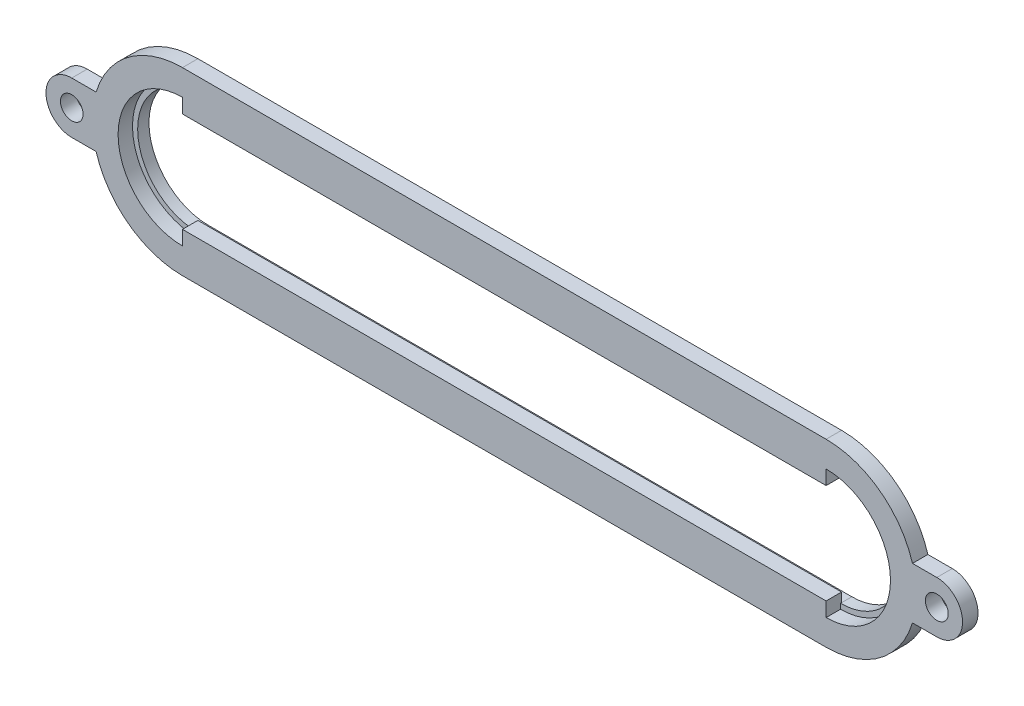
ISO-10303-21;
HEADER;
FILE_DESCRIPTION(('STEP AP214'),'2;1');
FILE_NAME('part.step','',(''),(''),'','','');
FILE_SCHEMA(('AUTOMOTIVE_DESIGN { 1 0 10303 214 1 1 1 1 }'));
ENDSEC;
DATA;
#1=APPLICATION_CONTEXT('core data for automotive mechanical design processes');
#2=APPLICATION_PROTOCOL_DEFINITION('international standard','automotive_design',2000,#1);
#3=PRODUCT_CONTEXT('',#1,'mechanical');
#4=PRODUCT('Part','Part','',(#3));
#5=PRODUCT_RELATED_PRODUCT_CATEGORY('part','',(#4));
#6=PRODUCT_DEFINITION_FORMATION('','',#4);
#7=PRODUCT_DEFINITION_CONTEXT('part definition',#1,'design');
#8=PRODUCT_DEFINITION('design','',#6,#7);
#9=PRODUCT_DEFINITION_SHAPE('','',#8);
#10=(LENGTH_UNIT() NAMED_UNIT(*) SI_UNIT(.MILLI.,.METRE.));
#11=(NAMED_UNIT(*) PLANE_ANGLE_UNIT() SI_UNIT($,.RADIAN.));
#12=(NAMED_UNIT(*) SI_UNIT($,.STERADIAN.) SOLID_ANGLE_UNIT());
#13=UNCERTAINTY_MEASURE_WITH_UNIT(LENGTH_MEASURE(1.E-05),#10,'distance_accuracy_value','');
#14=(GEOMETRIC_REPRESENTATION_CONTEXT(3) GLOBAL_UNCERTAINTY_ASSIGNED_CONTEXT((#13)) GLOBAL_UNIT_ASSIGNED_CONTEXT((#10,
#11,#12)) REPRESENTATION_CONTEXT('',''));
#15=CARTESIAN_POINT('',(0.,0.,0.));
#16=DIRECTION('',(0.,0.,1.));
#17=DIRECTION('',(1.,0.,0.));
#18=AXIS2_PLACEMENT_3D('',#15,#16,#17);
#19=CARTESIAN_POINT('',(19.1305960582726,0.,3.81));
#20=DIRECTION('',(0.,0.,-1.));
#21=DIRECTION('',(-1.,0.,0.));
#22=AXIS2_PLACEMENT_3D('',#19,#20,#21);
#23=CYLINDRICAL_SURFACE('',#22,22.225);
#24=DIRECTION('',(0.,0.,1.));
#25=VECTOR('',#24,1.);
#26=CARTESIAN_POINT('',(-2.16795142741293,6.35,0.));
#27=LINE('',#26,#25);
#28=CARTESIAN_POINT('',(-2.16795142741292,6.35,0.));
#29=VERTEX_POINT('',#28);
#30=CARTESIAN_POINT('',(-2.16795142741293,6.35,3.81));
#31=VERTEX_POINT('',#30);
#32=EDGE_CURVE('E274',#29,#31,#27,.T.);
#33=ORIENTED_EDGE('',*,*,#32,.T.);
#34=CARTESIAN_POINT('',(19.1305960582726,0.,3.81));
#35=DIRECTION('',(0.,0.,1.));
#36=DIRECTION('',(1.,0.,0.));
#37=AXIS2_PLACEMENT_3D('',#34,#35,#36);
#38=CIRCLE('',#37,22.225);
#39=CARTESIAN_POINT('',(19.1305960582726,22.225,3.81));
#40=VERTEX_POINT('',#39);
#41=EDGE_CURVE('E407',#31,#40,#38,.F.);
#42=ORIENTED_EDGE('',*,*,#41,.T.);
#43=DIRECTION('',(0.,0.,-1.));
#44=VECTOR('',#43,1.);
#45=CARTESIAN_POINT('',(19.1305960582726,22.225,3.81));
#46=LINE('',#45,#44);
#47=CARTESIAN_POINT('',(19.1305960582726,22.225,0.));
#48=VERTEX_POINT('',#47);
#49=EDGE_CURVE('E443',#40,#48,#46,.T.);
#50=ORIENTED_EDGE('',*,*,#49,.T.);
#51=CARTESIAN_POINT('',(19.1305960582726,0.,0.));
#52=DIRECTION('',(0.,0.,1.));
#53=DIRECTION('',(1.,0.,0.));
#54=AXIS2_PLACEMENT_3D('',#51,#52,#53);
#55=CIRCLE('',#54,22.225);
#56=EDGE_CURVE('E52',#29,#48,#55,.F.);
#57=ORIENTED_EDGE('',*,*,#56,.F.);
#58=EDGE_LOOP('',(#33,#42,#50,#57));
#59=FACE_BOUND('',#58,.T.);
#60=ADVANCED_FACE('F37',(#59),#23,.T.);
#61=CARTESIAN_POINT('',(177.880596058273,0.,3.81));
#62=DIRECTION('',(0.,0.,-1.));
#63=DIRECTION('',(-1.,0.,0.));
#64=AXIS2_PLACEMENT_3D('',#61,#62,#63);
#65=CYLINDRICAL_SURFACE('',#64,22.225);
#66=CARTESIAN_POINT('',(177.880596058273,0.,0.));
#67=DIRECTION('',(0.,0.,1.));
#68=DIRECTION('',(1.,0.,0.));
#69=AXIS2_PLACEMENT_3D('',#66,#67,#68);
#70=CIRCLE('',#69,22.225);
#71=CARTESIAN_POINT('',(177.880596058273,-22.225,0.));
#72=VERTEX_POINT('',#71);
#73=CARTESIAN_POINT('',(199.179143543958,-6.35,0.));
#74=VERTEX_POINT('',#73);
#75=EDGE_CURVE('E434',#72,#74,#70,.T.);
#76=ORIENTED_EDGE('',*,*,#75,.T.);
#77=DIRECTION('',(0.,0.,1.));
#78=VECTOR('',#77,1.);
#79=CARTESIAN_POINT('',(199.179143543958,-6.35,0.));
#80=LINE('',#79,#78);
#81=CARTESIAN_POINT('',(199.179143543958,-6.35,3.81));
#82=VERTEX_POINT('',#81);
#83=EDGE_CURVE('E302',#74,#82,#80,.T.);
#84=ORIENTED_EDGE('',*,*,#83,.T.);
#85=CARTESIAN_POINT('',(177.880596058273,0.,3.81));
#86=DIRECTION('',(0.,0.,1.));
#87=DIRECTION('',(1.,0.,0.));
#88=AXIS2_PLACEMENT_3D('',#85,#86,#87);
#89=CIRCLE('',#88,22.225);
#90=CARTESIAN_POINT('',(177.880596058273,-22.225,3.81));
#91=VERTEX_POINT('',#90);
#92=EDGE_CURVE('E401',#91,#82,#89,.T.);
#93=ORIENTED_EDGE('',*,*,#92,.F.);
#94=DIRECTION('',(0.,0.,-1.));
#95=VECTOR('',#94,1.);
#96=CARTESIAN_POINT('',(177.880596058273,-22.225,3.81));
#97=LINE('',#96,#95);
#98=EDGE_CURVE('E449',#91,#72,#97,.T.);
#99=ORIENTED_EDGE('',*,*,#98,.T.);
#100=EDGE_LOOP('',(#76,#84,#93,#99));
#101=FACE_BOUND('',#100,.T.);
#102=ADVANCED_FACE('F518',(#101),#65,.T.);
#103=CARTESIAN_POINT('',(19.1305960582726,0.,3.81));
#104=DIRECTION('',(1.,0.,0.));
#105=DIRECTION('',(0.,1.,0.));
#106=AXIS2_PLACEMENT_3D('',#103,#104,#105);
#107=PLANE('',#106);
#108=DIRECTION('',(0.,0.,-1.));
#109=VECTOR('',#108,1.);
#110=CARTESIAN_POINT('',(19.1305960582726,-14.605,0.254));
#111=LINE('',#110,#109);
#112=CARTESIAN_POINT('',(19.1305960582726,-14.605,0.254));
#113=VERTEX_POINT('',#112);
#114=CARTESIAN_POINT('',(19.1305960582726,-14.605,0.));
#115=VERTEX_POINT('',#114);
#116=EDGE_CURVE('E365',#113,#115,#111,.T.);
#117=ORIENTED_EDGE('',*,*,#116,.F.);
#118=DIRECTION('',(0.,1.,0.));
#119=VECTOR('',#118,1.);
#120=CARTESIAN_POINT('',(19.1305960582726,0.,0.254));
#121=LINE('',#120,#119);
#122=CARTESIAN_POINT('',(19.1305960582726,-15.875,0.254000000000001));
#123=VERTEX_POINT('',#122);
#124=EDGE_CURVE('E372',#123,#113,#121,.T.);
#125=ORIENTED_EDGE('',*,*,#124,.F.);
#126=DIRECTION('',(0.,0.,-1.));
#127=VECTOR('',#126,1.);
#128=CARTESIAN_POINT('',(19.1305960582726,-15.875,3.81));
#129=LINE('',#128,#127);
#130=CARTESIAN_POINT('',(19.1305960582726,-15.875,3.81));
#131=VERTEX_POINT('',#130);
#132=EDGE_CURVE('E444',#131,#123,#129,.T.);
#133=ORIENTED_EDGE('',*,*,#132,.F.);
#134=DIRECTION('',(0.,-1.,0.));
#135=VECTOR('',#134,1.);
#136=CARTESIAN_POINT('',(19.1305960582726,0.,3.81));
#137=LINE('',#136,#135);
#138=CARTESIAN_POINT('',(19.1305960582726,-12.319,3.81));
#139=VERTEX_POINT('',#138);
#140=EDGE_CURVE('E376',#139,#131,#137,.T.);
#141=ORIENTED_EDGE('',*,*,#140,.F.);
#142=DIRECTION('',(0.,0.,-1.));
#143=VECTOR('',#142,1.);
#144=CARTESIAN_POINT('',(19.1305960582726,-12.319,3.81));
#145=LINE('',#144,#143);
#146=CARTESIAN_POINT('',(19.1305960582726,-12.319,0.));
#147=VERTEX_POINT('',#146);
#148=EDGE_CURVE('E410',#139,#147,#145,.T.);
#149=ORIENTED_EDGE('',*,*,#148,.T.);
#150=DIRECTION('',(0.,-1.,0.));
#151=VECTOR('',#150,1.);
#152=CARTESIAN_POINT('',(19.1305960582726,0.,0.));
#153=LINE('',#152,#151);
#154=EDGE_CURVE('E375',#147,#115,#153,.T.);
#155=ORIENTED_EDGE('',*,*,#154,.T.);
#156=EDGE_LOOP('',(#117,#125,#133,#141,#149,#155));
#157=FACE_BOUND('',#156,.T.);
#158=ADVANCED_FACE('F39',(#157),#107,.F.);
#159=CARTESIAN_POINT('',(19.1305960582726,0.,3.81));
#160=DIRECTION('',(0.,0.,-1.));
#161=DIRECTION('',(-1.,0.,0.));
#162=AXIS2_PLACEMENT_3D('',#159,#160,#161);
#163=CYLINDRICAL_SURFACE('',#162,15.875);
#164=CARTESIAN_POINT('',(19.1305960582726,0.,0.254));
#165=DIRECTION('',(0.,0.,-1.));
#166=DIRECTION('',(-1.,0.,0.));
#167=AXIS2_PLACEMENT_3D('',#164,#165,#166);
#168=CIRCLE('',#167,15.875);
#169=CARTESIAN_POINT('',(19.1305960582726,15.875,0.254000000000001));
#170=VERTEX_POINT('',#169);
#171=EDGE_CURVE('E341',#170,#123,#168,.F.);
#172=ORIENTED_EDGE('',*,*,#171,.F.);
#173=DIRECTION('',(0.,0.,-1.));
#174=VECTOR('',#173,1.);
#175=CARTESIAN_POINT('',(19.1305960582726,15.875,3.81));
#176=LINE('',#175,#174);
#177=CARTESIAN_POINT('',(19.1305960582726,15.875,3.81));
#178=VERTEX_POINT('',#177);
#179=EDGE_CURVE('E468',#178,#170,#176,.T.);
#180=ORIENTED_EDGE('',*,*,#179,.F.);
#181=CARTESIAN_POINT('',(19.1305960582726,0.,3.81));
#182=DIRECTION('',(0.,0.,1.));
#183=DIRECTION('',(1.,0.,0.));
#184=AXIS2_PLACEMENT_3D('',#181,#182,#183);
#185=CIRCLE('',#184,15.875);
#186=EDGE_CURVE('E379',#131,#178,#185,.F.);
#187=ORIENTED_EDGE('',*,*,#186,.F.);
#188=ORIENTED_EDGE('',*,*,#132,.T.);
#189=EDGE_LOOP('',(#172,#180,#187,#188));
#190=FACE_BOUND('',#189,.T.);
#191=ADVANCED_FACE('F558',(#190),#163,.F.);
#192=CARTESIAN_POINT('',(177.880596058273,0.,3.81));
#193=DIRECTION('',(0.,0.,-1.));
#194=DIRECTION('',(-1.,0.,0.));
#195=AXIS2_PLACEMENT_3D('',#192,#193,#194);
#196=CYLINDRICAL_SURFACE('',#195,15.875);
#197=DIRECTION('',(0.,0.,-1.));
#198=VECTOR('',#197,1.);
#199=CARTESIAN_POINT('',(177.880596058273,15.875,3.81));
#200=LINE('',#199,#198);
#201=CARTESIAN_POINT('',(177.880596058273,15.875,3.81));
#202=VERTEX_POINT('',#201);
#203=CARTESIAN_POINT('',(177.880596058273,15.875,0.254000000000001));
#204=VERTEX_POINT('',#203);
#205=EDGE_CURVE('E459',#202,#204,#200,.T.);
#206=ORIENTED_EDGE('',*,*,#205,.T.);
#207=CARTESIAN_POINT('',(177.880596058273,0.,0.254));
#208=DIRECTION('',(0.,0.,-1.));
#209=DIRECTION('',(-1.,0.,0.));
#210=AXIS2_PLACEMENT_3D('',#207,#208,#209);
#211=CIRCLE('',#210,15.875);
#212=CARTESIAN_POINT('',(177.880596058273,-15.875,0.254000000000001));
#213=VERTEX_POINT('',#212);
#214=EDGE_CURVE('E338',#213,#204,#211,.F.);
#215=ORIENTED_EDGE('',*,*,#214,.F.);
#216=DIRECTION('',(0.,0.,-1.));
#217=VECTOR('',#216,1.);
#218=CARTESIAN_POINT('',(177.880596058273,-15.875,3.81));
#219=LINE('',#218,#217);
#220=CARTESIAN_POINT('',(177.880596058273,-15.875,3.81));
#221=VERTEX_POINT('',#220);
#222=EDGE_CURVE('E456',#221,#213,#219,.T.);
#223=ORIENTED_EDGE('',*,*,#222,.F.);
#224=CARTESIAN_POINT('',(177.880596058273,0.,3.81));
#225=DIRECTION('',(0.,0.,1.));
#226=DIRECTION('',(1.,0.,0.));
#227=AXIS2_PLACEMENT_3D('',#224,#225,#226);
#228=CIRCLE('',#227,15.875);
#229=EDGE_CURVE('E388',#221,#202,#228,.T.);
#230=ORIENTED_EDGE('',*,*,#229,.T.);
#231=EDGE_LOOP('',(#206,#215,#223,#230));
#232=FACE_BOUND('',#231,.T.);
#233=ADVANCED_FACE('F555',(#232),#196,.F.);
#234=CARTESIAN_POINT('',(177.880596058273,0.,3.81));
#235=DIRECTION('',(1.,0.,0.));
#236=DIRECTION('',(0.,0.,-1.));
#237=AXIS2_PLACEMENT_3D('',#234,#235,#236);
#238=PLANE('',#237);
#239=DIRECTION('',(0.,1.,0.));
#240=VECTOR('',#239,1.);
#241=CARTESIAN_POINT('',(177.880596058273,0.,0.254));
#242=LINE('',#241,#240);
#243=CARTESIAN_POINT('',(177.880596058273,-14.605,0.254));
#244=VERTEX_POINT('',#243);
#245=EDGE_CURVE('E11',#213,#244,#242,.T.);
#246=ORIENTED_EDGE('',*,*,#245,.T.);
#247=DIRECTION('',(0.,0.,-1.));
#248=VECTOR('',#247,1.);
#249=CARTESIAN_POINT('',(177.880596058273,-14.605,0.254));
#250=LINE('',#249,#248);
#251=CARTESIAN_POINT('',(177.880596058273,-14.605,0.));
#252=VERTEX_POINT('',#251);
#253=EDGE_CURVE('E361',#244,#252,#250,.T.);
#254=ORIENTED_EDGE('',*,*,#253,.T.);
#255=DIRECTION('',(0.,-1.,0.));
#256=VECTOR('',#255,1.);
#257=CARTESIAN_POINT('',(177.880596058273,0.,0.));
#258=LINE('',#257,#256);
#259=CARTESIAN_POINT('',(177.880596058273,-12.319,0.));
#260=VERTEX_POINT('',#259);
#261=EDGE_CURVE('E425',#260,#252,#258,.T.);
#262=ORIENTED_EDGE('',*,*,#261,.F.);
#263=DIRECTION('',(0.,0.,-1.));
#264=VECTOR('',#263,1.);
#265=CARTESIAN_POINT('',(177.880596058273,-12.319,3.81));
#266=LINE('',#265,#264);
#267=CARTESIAN_POINT('',(177.880596058273,-12.319,3.81));
#268=VERTEX_POINT('',#267);
#269=EDGE_CURVE('E454',#268,#260,#266,.T.);
#270=ORIENTED_EDGE('',*,*,#269,.F.);
#271=DIRECTION('',(0.,-1.,0.));
#272=VECTOR('',#271,1.);
#273=CARTESIAN_POINT('',(177.880596058273,0.,3.81));
#274=LINE('',#273,#272);
#275=EDGE_CURVE('E391',#268,#221,#274,.T.);
#276=ORIENTED_EDGE('',*,*,#275,.T.);
#277=ORIENTED_EDGE('',*,*,#222,.T.);
#278=EDGE_LOOP('',(#246,#254,#262,#270,#276,#277));
#279=FACE_BOUND('',#278,.T.);
#280=ADVANCED_FACE('F552',(#279),#238,.T.);
#281=CARTESIAN_POINT('',(0.,0.,0.));
#282=DIRECTION('',(0.,0.,1.));
#283=DIRECTION('',(1.,0.,0.));
#284=AXIS2_PLACEMENT_3D('',#281,#282,#283);
#285=PLANE('',#284);
#286=DIRECTION('',(1.,0.,0.));
#287=VECTOR('',#286,1.);
#288=CARTESIAN_POINT('',(0.,-22.225,0.));
#289=LINE('',#288,#287);
#290=CARTESIAN_POINT('',(19.1305960582726,-22.225,0.));
#291=VERTEX_POINT('',#290);
#292=EDGE_CURVE('E430',#291,#72,#289,.T.);
#293=ORIENTED_EDGE('',*,*,#292,.F.);
#294=CARTESIAN_POINT('',(-2.16795142741293,-6.35,0.));
#295=VERTEX_POINT('',#294);
#296=EDGE_CURVE('E255',#291,#295,#55,.F.);
#297=ORIENTED_EDGE('',*,*,#296,.T.);
#298=DIRECTION('',(1.,0.,0.));
#299=VECTOR('',#298,1.);
#300=CARTESIAN_POINT('',(-8.17440394172742,-6.35,0.));
#301=LINE('',#300,#299);
#302=CARTESIAN_POINT('',(-8.17440394172742,-6.35,0.));
#303=VERTEX_POINT('',#302);
#304=EDGE_CURVE('E238',#303,#295,#301,.T.);
#305=ORIENTED_EDGE('',*,*,#304,.F.);
#306=CARTESIAN_POINT('',(-8.17440394172742,0.,0.));
#307=DIRECTION('',(0.,0.,1.));
#308=DIRECTION('',(1.,0.,0.));
#309=AXIS2_PLACEMENT_3D('',#306,#307,#308);
#310=CIRCLE('',#309,6.35);
#311=CARTESIAN_POINT('',(-8.17440394172742,6.35,0.));
#312=VERTEX_POINT('',#311);
#313=EDGE_CURVE('E253',#312,#303,#310,.T.);
#314=ORIENTED_EDGE('',*,*,#313,.F.);
#315=DIRECTION('',(-1.,0.,0.));
#316=VECTOR('',#315,1.);
#317=CARTESIAN_POINT('',(-8.17440394172742,6.35,0.));
#318=LINE('',#317,#316);
#319=EDGE_CURVE('E245',#29,#312,#318,.T.);
#320=ORIENTED_EDGE('',*,*,#319,.F.);
#321=ORIENTED_EDGE('',*,*,#56,.T.);
#322=DIRECTION('',(1.,0.,0.));
#323=VECTOR('',#322,1.);
#324=CARTESIAN_POINT('',(0.,22.225,0.));
#325=LINE('',#324,#323);
#326=CARTESIAN_POINT('',(177.880596058273,22.225,0.));
#327=VERTEX_POINT('',#326);
#328=EDGE_CURVE('E437',#48,#327,#325,.T.);
#329=ORIENTED_EDGE('',*,*,#328,.T.);
#330=CARTESIAN_POINT('',(199.179143543958,6.35,0.));
#331=VERTEX_POINT('',#330);
#332=EDGE_CURVE('E433',#331,#327,#70,.T.);
#333=ORIENTED_EDGE('',*,*,#332,.F.);
#334=DIRECTION('',(-1.,0.,0.));
#335=VECTOR('',#334,1.);
#336=CARTESIAN_POINT('',(205.185596058273,6.35,0.));
#337=LINE('',#336,#335);
#338=CARTESIAN_POINT('',(205.185596058273,6.35,0.));
#339=VERTEX_POINT('',#338);
#340=EDGE_CURVE('E286',#339,#331,#337,.T.);
#341=ORIENTED_EDGE('',*,*,#340,.F.);
#342=CARTESIAN_POINT('',(205.185596058273,0.,0.));
#343=DIRECTION('',(0.,0.,1.));
#344=DIRECTION('',(1.,0.,0.));
#345=AXIS2_PLACEMENT_3D('',#342,#343,#344);
#346=CIRCLE('',#345,6.35);
#347=CARTESIAN_POINT('',(205.185596058273,-6.35,0.));
#348=VERTEX_POINT('',#347);
#349=EDGE_CURVE('E283',#348,#339,#346,.T.);
#350=ORIENTED_EDGE('',*,*,#349,.F.);
#351=DIRECTION('',(1.,0.,0.));
#352=VECTOR('',#351,1.);
#353=CARTESIAN_POINT('',(205.185596058273,-6.35,0.));
#354=LINE('',#353,#352);
#355=EDGE_CURVE('E289',#74,#348,#354,.T.);
#356=ORIENTED_EDGE('',*,*,#355,.F.);
#357=ORIENTED_EDGE('',*,*,#75,.F.);
#358=EDGE_LOOP('',(#293,#297,#305,#314,#320,#321,#329,#333,#341,#350,#356,#357));
#359=FACE_BOUND('',#358,.T.);
#360=DIRECTION('',(1.,0.,0.));
#361=VECTOR('',#360,1.);
#362=CARTESIAN_POINT('',(0.,15.875,0.));
#363=LINE('',#362,#361);
#364=CARTESIAN_POINT('',(19.1305960582726,15.875,0.));
#365=VERTEX_POINT('',#364);
#366=CARTESIAN_POINT('',(177.880596058273,15.875,0.));
#367=VERTEX_POINT('',#366);
#368=EDGE_CURVE('E45',#365,#367,#363,.T.);
#369=ORIENTED_EDGE('',*,*,#368,.F.);
#370=CARTESIAN_POINT('',(19.1305960582726,0.,0.));
#371=DIRECTION('',(0.,0.,1.));
#372=DIRECTION('',(1.,0.,0.));
#373=AXIS2_PLACEMENT_3D('',#370,#371,#372);
#374=CIRCLE('',#373,15.875);
#375=CARTESIAN_POINT('',(19.1305960582726,-15.875,0.));
#376=VERTEX_POINT('',#375);
#377=EDGE_CURVE('E413',#376,#365,#374,.F.);
#378=ORIENTED_EDGE('',*,*,#377,.F.);
#379=DIRECTION('',(1.,0.,0.));
#380=VECTOR('',#379,1.);
#381=CARTESIAN_POINT('',(0.,-15.875,0.));
#382=LINE('',#381,#380);
#383=CARTESIAN_POINT('',(177.880596058273,-15.875,0.));
#384=VERTEX_POINT('',#383);
#385=EDGE_CURVE('E452',#376,#384,#382,.T.);
#386=ORIENTED_EDGE('',*,*,#385,.T.);
#387=CARTESIAN_POINT('',(177.880596058273,0.,0.));
#388=DIRECTION('',(0.,0.,1.));
#389=DIRECTION('',(1.,0.,0.));
#390=AXIS2_PLACEMENT_3D('',#387,#388,#389);
#391=CIRCLE('',#390,15.875);
#392=EDGE_CURVE('E422',#384,#367,#391,.T.);
#393=ORIENTED_EDGE('',*,*,#392,.T.);
#394=EDGE_LOOP('',(#369,#378,#386,#393));
#395=FACE_BOUND('',#394,.T.);
#396=CARTESIAN_POINT('',(205.185596058273,0.,0.));
#397=DIRECTION('',(0.,0.,1.));
#398=DIRECTION('',(1.,0.,0.));
#399=AXIS2_PLACEMENT_3D('',#396,#397,#398);
#400=CIRCLE('',#399,2.82045953882427);
#401=CARTESIAN_POINT('',(208.006055597097,0.,0.));
#402=VERTEX_POINT('',#401);
#403=EDGE_CURVE('E277',#402,#402,#400,.T.);
#404=ORIENTED_EDGE('',*,*,#403,.T.);
#405=EDGE_LOOP('',(#404));
#406=FACE_BOUND('',#405,.T.);
#407=CARTESIAN_POINT('',(-8.17440394172742,0.,0.));
#408=DIRECTION('',(0.,0.,1.));
#409=DIRECTION('',(1.,0.,0.));
#410=AXIS2_PLACEMENT_3D('',#407,#408,#409);
#411=CIRCLE('',#410,2.794);
#412=CARTESIAN_POINT('',(-5.38040394172743,0.,0.));
#413=VERTEX_POINT('',#412);
#414=EDGE_CURVE('E270',#413,#413,#411,.T.);
#415=ORIENTED_EDGE('',*,*,#414,.T.);
#416=EDGE_LOOP('',(#415));
#417=FACE_BOUND('',#416,.T.);
#418=ADVANCED_FACE('F250',(#359,#395,#406,#417),#285,.F.);
#419=DIRECTION('',(1.,0.,0.));
#420=VECTOR('',#419,1.);
#421=CARTESIAN_POINT('',(0.,-14.605,0.));
#422=LINE('',#421,#420);
#423=EDGE_CURVE('E475',#115,#252,#422,.T.);
#424=ORIENTED_EDGE('',*,*,#423,.F.);
#425=ORIENTED_EDGE('',*,*,#154,.F.);
#426=DIRECTION('',(1.,0.,0.));
#427=VECTOR('',#426,1.);
#428=CARTESIAN_POINT('',(0.,-12.319,0.));
#429=LINE('',#428,#427);
#430=EDGE_CURVE('E427',#147,#260,#429,.T.);
#431=ORIENTED_EDGE('',*,*,#430,.T.);
#432=ORIENTED_EDGE('',*,*,#261,.T.);
#433=EDGE_LOOP('',(#424,#425,#431,#432));
#434=FACE_BOUND('',#433,.T.);
#435=ADVANCED_FACE('F615',(#434),#285,.F.);
#436=CARTESIAN_POINT('',(0.,-22.225,3.81));
#437=DIRECTION('',(0.,1.,0.));
#438=DIRECTION('',(-1.,0.,0.));
#439=AXIS2_PLACEMENT_3D('',#436,#437,#438);
#440=PLANE('',#439);
#441=ORIENTED_EDGE('',*,*,#292,.T.);
#442=ORIENTED_EDGE('',*,*,#98,.F.);
#443=DIRECTION('',(1.,0.,0.));
#444=VECTOR('',#443,1.);
#445=CARTESIAN_POINT('',(0.,-22.225,3.81));
#446=LINE('',#445,#444);
#447=CARTESIAN_POINT('',(19.1305960582726,-22.225,3.81));
#448=VERTEX_POINT('',#447);
#449=EDGE_CURVE('E397',#448,#91,#446,.T.);
#450=ORIENTED_EDGE('',*,*,#449,.F.);
#451=DIRECTION('',(0.,0.,-1.));
#452=VECTOR('',#451,1.);
#453=CARTESIAN_POINT('',(19.1305960582726,-22.225,3.81));
#454=LINE('',#453,#452);
#455=EDGE_CURVE('E441',#448,#291,#454,.T.);
#456=ORIENTED_EDGE('',*,*,#455,.T.);
#457=EDGE_LOOP('',(#441,#442,#450,#456));
#458=FACE_BOUND('',#457,.T.);
#459=ADVANCED_FACE('F551',(#458),#440,.F.);
#460=CARTESIAN_POINT('',(199.179143543958,6.35,3.81));
#461=VERTEX_POINT('',#460);
#462=CARTESIAN_POINT('',(177.880596058273,22.225,3.81));
#463=VERTEX_POINT('',#462);
#464=EDGE_CURVE('E400',#461,#463,#89,.T.);
#465=ORIENTED_EDGE('',*,*,#464,.F.);
#466=DIRECTION('',(0.,0.,1.));
#467=VECTOR('',#466,1.);
#468=CARTESIAN_POINT('',(199.179143543958,6.35,0.));
#469=LINE('',#468,#467);
#470=EDGE_CURVE('E305',#331,#461,#469,.T.);
#471=ORIENTED_EDGE('',*,*,#470,.F.);
#472=ORIENTED_EDGE('',*,*,#332,.T.);
#473=DIRECTION('',(0.,0.,-1.));
#474=VECTOR('',#473,1.);
#475=CARTESIAN_POINT('',(177.880596058273,22.225,3.81));
#476=LINE('',#475,#474);
#477=EDGE_CURVE('E446',#463,#327,#476,.T.);
#478=ORIENTED_EDGE('',*,*,#477,.F.);
#479=EDGE_LOOP('',(#465,#471,#472,#478));
#480=FACE_BOUND('',#479,.T.);
#481=ADVANCED_FACE('F526',(#480),#65,.T.);
#482=CARTESIAN_POINT('',(0.,22.225,3.81));
#483=DIRECTION('',(0.,1.,0.));
#484=DIRECTION('',(0.,0.,1.));
#485=AXIS2_PLACEMENT_3D('',#482,#483,#484);
#486=PLANE('',#485);
#487=ORIENTED_EDGE('',*,*,#328,.F.);
#488=ORIENTED_EDGE('',*,*,#49,.F.);
#489=DIRECTION('',(1.,0.,0.));
#490=VECTOR('',#489,1.);
#491=CARTESIAN_POINT('',(0.,22.225,3.81));
#492=LINE('',#491,#490);
#493=EDGE_CURVE('E404',#40,#463,#492,.T.);
#494=ORIENTED_EDGE('',*,*,#493,.T.);
#495=ORIENTED_EDGE('',*,*,#477,.T.);
#496=EDGE_LOOP('',(#487,#488,#494,#495));
#497=FACE_BOUND('',#496,.T.);
#498=ADVANCED_FACE('F566',(#497),#486,.T.);
#499=CARTESIAN_POINT('',(19.1305960582726,0.,3.81));
#500=DIRECTION('',(1.,0.,0.));
#501=DIRECTION('',(0.,0.,-1.));
#502=AXIS2_PLACEMENT_3D('',#499,#500,#501);
#503=PLANE('',#502);
#504=DIRECTION('',(0.,1.,0.));
#505=VECTOR('',#504,1.);
#506=CARTESIAN_POINT('',(19.1305960582726,0.,0.254));
#507=LINE('',#506,#505);
#508=CARTESIAN_POINT('',(19.1305960582726,14.605,0.254));
#509=VERTEX_POINT('',#508);
#510=EDGE_CURVE('E369',#509,#170,#507,.T.);
#511=ORIENTED_EDGE('',*,*,#510,.F.);
#512=DIRECTION('',(0.,0.,-1.));
#513=VECTOR('',#512,1.);
#514=CARTESIAN_POINT('',(19.1305960582726,14.605,0.254));
#515=LINE('',#514,#513);
#516=CARTESIAN_POINT('',(19.1305960582726,14.605,0.));
#517=VERTEX_POINT('',#516);
#518=EDGE_CURVE('E354',#509,#517,#515,.T.);
#519=ORIENTED_EDGE('',*,*,#518,.T.);
#520=DIRECTION('',(0.,-1.,0.));
#521=VECTOR('',#520,1.);
#522=CARTESIAN_POINT('',(19.1305960582726,0.,0.));
#523=LINE('',#522,#521);
#524=CARTESIAN_POINT('',(19.1305960582726,12.319,0.));
#525=VERTEX_POINT('',#524);
#526=EDGE_CURVE('E415',#517,#525,#523,.T.);
#527=ORIENTED_EDGE('',*,*,#526,.T.);
#528=DIRECTION('',(0.,0.,-1.));
#529=VECTOR('',#528,1.);
#530=CARTESIAN_POINT('',(19.1305960582726,12.319,3.81));
#531=LINE('',#530,#529);
#532=CARTESIAN_POINT('',(19.1305960582726,12.319,3.81));
#533=VERTEX_POINT('',#532);
#534=EDGE_CURVE('E465',#533,#525,#531,.T.);
#535=ORIENTED_EDGE('',*,*,#534,.F.);
#536=DIRECTION('',(0.,-1.,0.));
#537=VECTOR('',#536,1.);
#538=CARTESIAN_POINT('',(19.1305960582726,0.,3.81));
#539=LINE('',#538,#537);
#540=EDGE_CURVE('E381',#178,#533,#539,.T.);
#541=ORIENTED_EDGE('',*,*,#540,.F.);
#542=ORIENTED_EDGE('',*,*,#179,.T.);
#543=EDGE_LOOP('',(#511,#519,#527,#535,#541,#542));
#544=FACE_BOUND('',#543,.T.);
#545=ADVANCED_FACE('F563',(#544),#503,.F.);
#546=CARTESIAN_POINT('',(0.,12.319,3.81));
#547=DIRECTION('',(0.,1.,0.));
#548=DIRECTION('',(0.,0.,1.));
#549=AXIS2_PLACEMENT_3D('',#546,#547,#548);
#550=PLANE('',#549);
#551=DIRECTION('',(1.,0.,0.));
#552=VECTOR('',#551,1.);
#553=CARTESIAN_POINT('',(0.,12.319,0.));
#554=LINE('',#553,#552);
#555=CARTESIAN_POINT('',(177.880596058273,12.319,0.));
#556=VERTEX_POINT('',#555);
#557=EDGE_CURVE('E417',#525,#556,#554,.T.);
#558=ORIENTED_EDGE('',*,*,#557,.T.);
#559=DIRECTION('',(0.,0.,-1.));
#560=VECTOR('',#559,1.);
#561=CARTESIAN_POINT('',(177.880596058273,12.319,3.81));
#562=LINE('',#561,#560);
#563=CARTESIAN_POINT('',(177.880596058273,12.319,3.81));
#564=VERTEX_POINT('',#563);
#565=EDGE_CURVE('E462',#564,#556,#562,.T.);
#566=ORIENTED_EDGE('',*,*,#565,.F.);
#567=DIRECTION('',(1.,0.,0.));
#568=VECTOR('',#567,1.);
#569=CARTESIAN_POINT('',(0.,12.319,3.81));
#570=LINE('',#569,#568);
#571=EDGE_CURVE('E383',#533,#564,#570,.T.);
#572=ORIENTED_EDGE('',*,*,#571,.F.);
#573=ORIENTED_EDGE('',*,*,#534,.T.);
#574=EDGE_LOOP('',(#558,#566,#572,#573));
#575=FACE_BOUND('',#574,.T.);
#576=ADVANCED_FACE('F545',(#575),#550,.F.);
#577=CARTESIAN_POINT('',(177.880596058273,0.,3.81));
#578=DIRECTION('',(1.,0.,0.));
#579=DIRECTION('',(0.,0.,-1.));
#580=AXIS2_PLACEMENT_3D('',#577,#578,#579);
#581=PLANE('',#580);
#582=DIRECTION('',(0.,0.,-1.));
#583=VECTOR('',#582,1.);
#584=CARTESIAN_POINT('',(177.880596058273,14.605,0.254));
#585=LINE('',#584,#583);
#586=CARTESIAN_POINT('',(177.880596058273,14.605,0.254));
#587=VERTEX_POINT('',#586);
#588=CARTESIAN_POINT('',(177.880596058273,14.605,0.));
#589=VERTEX_POINT('',#588);
#590=EDGE_CURVE('E357',#587,#589,#585,.T.);
#591=ORIENTED_EDGE('',*,*,#590,.F.);
#592=DIRECTION('',(0.,1.,0.));
#593=VECTOR('',#592,1.);
#594=CARTESIAN_POINT('',(177.880596058273,0.,0.254));
#595=LINE('',#594,#593);
#596=EDGE_CURVE('E347',#587,#204,#595,.T.);
#597=ORIENTED_EDGE('',*,*,#596,.T.);
#598=ORIENTED_EDGE('',*,*,#205,.F.);
#599=DIRECTION('',(0.,-1.,0.));
#600=VECTOR('',#599,1.);
#601=CARTESIAN_POINT('',(177.880596058273,0.,3.81));
#602=LINE('',#601,#600);
#603=EDGE_CURVE('E385',#202,#564,#602,.T.);
#604=ORIENTED_EDGE('',*,*,#603,.T.);
#605=ORIENTED_EDGE('',*,*,#565,.T.);
#606=DIRECTION('',(0.,-1.,0.));
#607=VECTOR('',#606,1.);
#608=CARTESIAN_POINT('',(177.880596058273,0.,0.));
#609=LINE('',#608,#607);
#610=EDGE_CURVE('E420',#589,#556,#609,.T.);
#611=ORIENTED_EDGE('',*,*,#610,.F.);
#612=EDGE_LOOP('',(#591,#597,#598,#604,#605,#611));
#613=FACE_BOUND('',#612,.T.);
#614=ADVANCED_FACE('F539',(#613),#581,.T.);
#615=CARTESIAN_POINT('',(0.,-12.319,3.81));
#616=DIRECTION('',(0.,1.,0.));
#617=DIRECTION('',(-1.,0.,0.));
#618=AXIS2_PLACEMENT_3D('',#615,#616,#617);
#619=PLANE('',#618);
#620=ORIENTED_EDGE('',*,*,#430,.F.);
#621=ORIENTED_EDGE('',*,*,#148,.F.);
#622=DIRECTION('',(1.,0.,0.));
#623=VECTOR('',#622,1.);
#624=CARTESIAN_POINT('',(0.,-12.319,3.81));
#625=LINE('',#624,#623);
#626=EDGE_CURVE('E394',#139,#268,#625,.T.);
#627=ORIENTED_EDGE('',*,*,#626,.T.);
#628=ORIENTED_EDGE('',*,*,#269,.T.);
#629=EDGE_LOOP('',(#620,#621,#627,#628));
#630=FACE_BOUND('',#629,.T.);
#631=ADVANCED_FACE('F531',(#630),#619,.T.);
#632=DIRECTION('',(0.,0.,1.));
#633=VECTOR('',#632,1.);
#634=CARTESIAN_POINT('',(-2.16795142741293,-6.35,0.));
#635=LINE('',#634,#633);
#636=CARTESIAN_POINT('',(-2.16795142741293,-6.35,3.81));
#637=VERTEX_POINT('',#636);
#638=EDGE_CURVE('E60',#295,#637,#635,.T.);
#639=ORIENTED_EDGE('',*,*,#638,.F.);
#640=ORIENTED_EDGE('',*,*,#296,.F.);
#641=ORIENTED_EDGE('',*,*,#455,.F.);
#642=EDGE_CURVE('E408',#448,#637,#38,.F.);
#643=ORIENTED_EDGE('',*,*,#642,.T.);
#644=EDGE_LOOP('',(#639,#640,#641,#643));
#645=FACE_BOUND('',#644,.T.);
#646=ADVANCED_FACE('F520',(#645),#23,.T.);
#647=CARTESIAN_POINT('',(0.,0.,3.81));
#648=DIRECTION('',(0.,0.,1.));
#649=DIRECTION('',(1.,0.,0.));
#650=AXIS2_PLACEMENT_3D('',#647,#648,#649);
#651=PLANE('',#650);
#652=ORIENTED_EDGE('',*,*,#140,.T.);
#653=ORIENTED_EDGE('',*,*,#186,.T.);
#654=ORIENTED_EDGE('',*,*,#540,.T.);
#655=ORIENTED_EDGE('',*,*,#571,.T.);
#656=ORIENTED_EDGE('',*,*,#603,.F.);
#657=ORIENTED_EDGE('',*,*,#229,.F.);
#658=ORIENTED_EDGE('',*,*,#275,.F.);
#659=ORIENTED_EDGE('',*,*,#626,.F.);
#660=EDGE_LOOP('',(#652,#653,#654,#655,#656,#657,#658,#659));
#661=FACE_BOUND('',#660,.T.);
#662=ORIENTED_EDGE('',*,*,#449,.T.);
#663=ORIENTED_EDGE('',*,*,#92,.T.);
#664=DIRECTION('',(1.,0.,0.));
#665=VECTOR('',#664,1.);
#666=CARTESIAN_POINT('',(205.185596058273,-6.35,3.81));
#667=LINE('',#666,#665);
#668=CARTESIAN_POINT('',(205.185596058273,-6.35,3.81));
#669=VERTEX_POINT('',#668);
#670=EDGE_CURVE('E287',#82,#669,#667,.T.);
#671=ORIENTED_EDGE('',*,*,#670,.T.);
#672=CARTESIAN_POINT('',(205.185596058273,0.,3.81));
#673=DIRECTION('',(0.,0.,1.));
#674=DIRECTION('',(1.,0.,0.));
#675=AXIS2_PLACEMENT_3D('',#672,#673,#674);
#676=CIRCLE('',#675,6.35);
#677=CARTESIAN_POINT('',(205.185596058273,6.35,3.81));
#678=VERTEX_POINT('',#677);
#679=EDGE_CURVE('E280',#669,#678,#676,.T.);
#680=ORIENTED_EDGE('',*,*,#679,.T.);
#681=DIRECTION('',(-1.,0.,0.));
#682=VECTOR('',#681,1.);
#683=CARTESIAN_POINT('',(205.185596058273,6.35,3.81));
#684=LINE('',#683,#682);
#685=EDGE_CURVE('E295',#678,#461,#684,.T.);
#686=ORIENTED_EDGE('',*,*,#685,.T.);
#687=ORIENTED_EDGE('',*,*,#464,.T.);
#688=ORIENTED_EDGE('',*,*,#493,.F.);
#689=ORIENTED_EDGE('',*,*,#41,.F.);
#690=DIRECTION('',(-1.,0.,0.));
#691=VECTOR('',#690,1.);
#692=CARTESIAN_POINT('',(-8.17440394172742,6.35,3.81));
#693=LINE('',#692,#691);
#694=CARTESIAN_POINT('',(-8.17440394172742,6.35,3.81));
#695=VERTEX_POINT('',#694);
#696=EDGE_CURVE('E259',#31,#695,#693,.T.);
#697=ORIENTED_EDGE('',*,*,#696,.T.);
#698=CARTESIAN_POINT('',(-8.17440394172742,0.,3.81));
#699=DIRECTION('',(0.,0.,1.));
#700=DIRECTION('',(1.,0.,0.));
#701=AXIS2_PLACEMENT_3D('',#698,#699,#700);
#702=CIRCLE('',#701,6.35);
#703=CARTESIAN_POINT('',(-8.17440394172742,-6.35,3.81));
#704=VERTEX_POINT('',#703);
#705=EDGE_CURVE('E268',#695,#704,#702,.T.);
#706=ORIENTED_EDGE('',*,*,#705,.T.);
#707=DIRECTION('',(1.,0.,0.));
#708=VECTOR('',#707,1.);
#709=CARTESIAN_POINT('',(-8.17440394172742,-6.35,3.81));
#710=LINE('',#709,#708);
#711=EDGE_CURVE('E240',#704,#637,#710,.T.);
#712=ORIENTED_EDGE('',*,*,#711,.T.);
#713=ORIENTED_EDGE('',*,*,#642,.F.);
#714=EDGE_LOOP('',(#662,#663,#671,#680,#686,#687,#688,#689,#697,#706,#712,#713));
#715=FACE_BOUND('',#714,.T.);
#716=CARTESIAN_POINT('',(205.185596058273,0.,3.81));
#717=DIRECTION('',(0.,0.,1.));
#718=DIRECTION('',(1.,0.,0.));
#719=AXIS2_PLACEMENT_3D('',#716,#717,#718);
#720=CIRCLE('',#719,2.82045953882427);
#721=CARTESIAN_POINT('',(208.006055597097,0.,3.81));
#722=VERTEX_POINT('',#721);
#723=EDGE_CURVE('E273',#722,#722,#720,.T.);
#724=ORIENTED_EDGE('',*,*,#723,.F.);
#725=EDGE_LOOP('',(#724));
#726=FACE_BOUND('',#725,.T.);
#727=CARTESIAN_POINT('',(-8.17440394172742,0.,3.81));
#728=DIRECTION('',(0.,0.,1.));
#729=DIRECTION('',(1.,0.,0.));
#730=AXIS2_PLACEMENT_3D('',#727,#728,#729);
#731=CIRCLE('',#730,2.794);
#732=CARTESIAN_POINT('',(-5.38040394172743,0.,3.81));
#733=VERTEX_POINT('',#732);
#734=EDGE_CURVE('E264',#733,#733,#731,.T.);
#735=ORIENTED_EDGE('',*,*,#734,.F.);
#736=EDGE_LOOP('',(#735));
#737=FACE_BOUND('',#736,.T.);
#738=ADVANCED_FACE('F530',(#661,#715,#726,#737),#651,.T.);
#739=ORIENTED_EDGE('',*,*,#526,.F.);
#740=DIRECTION('',(1.,0.,0.));
#741=VECTOR('',#740,1.);
#742=CARTESIAN_POINT('',(0.,14.605,0.));
#743=LINE('',#742,#741);
#744=EDGE_CURVE('E478',#517,#589,#743,.T.);
#745=ORIENTED_EDGE('',*,*,#744,.T.);
#746=ORIENTED_EDGE('',*,*,#610,.T.);
#747=ORIENTED_EDGE('',*,*,#557,.F.);
#748=EDGE_LOOP('',(#739,#745,#746,#747));
#749=FACE_BOUND('',#748,.T.);
#750=ADVANCED_FACE('F536',(#749),#285,.F.);
#751=CARTESIAN_POINT('',(0.,0.,0.254));
#752=DIRECTION('',(0.,0.,-1.));
#753=DIRECTION('',(-1.,0.,0.));
#754=AXIS2_PLACEMENT_3D('',#751,#752,#753);
#755=PLANE('',#754);
#756=ORIENTED_EDGE('',*,*,#171,.T.);
#757=ORIENTED_EDGE('',*,*,#124,.T.);
#758=CARTESIAN_POINT('',(19.1305960582726,0.,0.254));
#759=DIRECTION('',(0.,0.,-1.));
#760=DIRECTION('',(-1.,0.,0.));
#761=AXIS2_PLACEMENT_3D('',#758,#759,#760);
#762=CIRCLE('',#761,14.605);
#763=EDGE_CURVE('E332',#113,#509,#762,.T.);
#764=ORIENTED_EDGE('',*,*,#763,.T.);
#765=ORIENTED_EDGE('',*,*,#510,.T.);
#766=EDGE_LOOP('',(#756,#757,#764,#765));
#767=FACE_BOUND('',#766,.T.);
#768=ADVANCED_FACE('F515',(#767),#755,.F.);
#769=CARTESIAN_POINT('',(177.880596058273,0.,0.254));
#770=DIRECTION('',(0.,0.,-1.));
#771=DIRECTION('',(-1.,0.,0.));
#772=AXIS2_PLACEMENT_3D('',#769,#770,#771);
#773=CYLINDRICAL_SURFACE('',#772,15.875);
#774=DIRECTION('',(0.,0.,-1.));
#775=VECTOR('',#774,1.);
#776=CARTESIAN_POINT('',(177.880596058273,15.875,0.254));
#777=LINE('',#776,#775);
#778=CARTESIAN_POINT('',(177.880596058273,15.875,-2.54));
#779=VERTEX_POINT('',#778);
#780=EDGE_CURVE('E345',#367,#779,#777,.T.);
#781=ORIENTED_EDGE('',*,*,#780,.F.);
#782=ORIENTED_EDGE('',*,*,#392,.F.);
#783=DIRECTION('',(0.,0.,-1.));
#784=VECTOR('',#783,1.);
#785=CARTESIAN_POINT('',(177.880596058273,-15.875,0.254));
#786=LINE('',#785,#784);
#787=CARTESIAN_POINT('',(177.880596058273,-15.875,-2.54));
#788=VERTEX_POINT('',#787);
#789=EDGE_CURVE('E352',#384,#788,#786,.T.);
#790=ORIENTED_EDGE('',*,*,#789,.T.);
#791=CARTESIAN_POINT('',(177.880596058273,0.,-2.54));
#792=DIRECTION('',(0.,0.,-1.));
#793=DIRECTION('',(-1.,0.,0.));
#794=AXIS2_PLACEMENT_3D('',#791,#792,#793);
#795=CIRCLE('',#794,15.875);
#796=EDGE_CURVE('E320',#788,#779,#795,.F.);
#797=ORIENTED_EDGE('',*,*,#796,.T.);
#798=EDGE_LOOP('',(#781,#782,#790,#797));
#799=FACE_BOUND('',#798,.T.);
#800=ADVANCED_FACE('F487',(#799),#773,.T.);
#801=CARTESIAN_POINT('',(0.,15.875,0.254));
#802=DIRECTION('',(0.,-1.,0.));
#803=DIRECTION('',(0.,0.,-1.));
#804=AXIS2_PLACEMENT_3D('',#801,#802,#803);
#805=PLANE('',#804);
#806=DIRECTION('',(0.,0.,-1.));
#807=VECTOR('',#806,1.);
#808=CARTESIAN_POINT('',(19.1305960582726,15.875,0.254));
#809=LINE('',#808,#807);
#810=CARTESIAN_POINT('',(19.1305960582726,15.875,-2.54));
#811=VERTEX_POINT('',#810);
#812=EDGE_CURVE('E348',#365,#811,#809,.T.);
#813=ORIENTED_EDGE('',*,*,#812,.F.);
#814=ORIENTED_EDGE('',*,*,#368,.T.);
#815=ORIENTED_EDGE('',*,*,#780,.T.);
#816=DIRECTION('',(-1.,0.,0.));
#817=VECTOR('',#816,1.);
#818=CARTESIAN_POINT('',(0.,15.875,-2.54));
#819=LINE('',#818,#817);
#820=EDGE_CURVE('E329',#779,#811,#819,.T.);
#821=ORIENTED_EDGE('',*,*,#820,.T.);
#822=EDGE_LOOP('',(#813,#814,#815,#821));
#823=FACE_BOUND('',#822,.T.);
#824=ADVANCED_FACE('F483',(#823),#805,.F.);
#825=CARTESIAN_POINT('',(19.1305960582726,0.,0.254));
#826=DIRECTION('',(0.,0.,-1.));
#827=DIRECTION('',(-1.,0.,0.));
#828=AXIS2_PLACEMENT_3D('',#825,#826,#827);
#829=CYLINDRICAL_SURFACE('',#828,15.875);
#830=DIRECTION('',(0.,0.,-1.));
#831=VECTOR('',#830,1.);
#832=CARTESIAN_POINT('',(19.1305960582726,-15.875,0.254));
#833=LINE('',#832,#831);
#834=CARTESIAN_POINT('',(19.1305960582726,-15.875,-2.54));
#835=VERTEX_POINT('',#834);
#836=EDGE_CURVE('E350',#376,#835,#833,.T.);
#837=ORIENTED_EDGE('',*,*,#836,.F.);
#838=ORIENTED_EDGE('',*,*,#377,.T.);
#839=ORIENTED_EDGE('',*,*,#812,.T.);
#840=CARTESIAN_POINT('',(19.1305960582726,0.,-2.54));
#841=DIRECTION('',(0.,0.,-1.));
#842=DIRECTION('',(-1.,0.,0.));
#843=AXIS2_PLACEMENT_3D('',#840,#841,#842);
#844=CIRCLE('',#843,15.875);
#845=EDGE_CURVE('E326',#811,#835,#844,.F.);
#846=ORIENTED_EDGE('',*,*,#845,.T.);
#847=EDGE_LOOP('',(#837,#838,#839,#846));
#848=FACE_BOUND('',#847,.T.);
#849=ADVANCED_FACE('F496',(#848),#829,.T.);
#850=CARTESIAN_POINT('',(0.,14.605,0.254));
#851=DIRECTION('',(0.,-1.,0.));
#852=DIRECTION('',(0.,0.,-1.));
#853=AXIS2_PLACEMENT_3D('',#850,#851,#852);
#854=PLANE('',#853);
#855=ORIENTED_EDGE('',*,*,#744,.F.);
#856=CARTESIAN_POINT('',(19.1305960582726,14.605,-2.54));
#857=VERTEX_POINT('',#856);
#858=EDGE_CURVE('E356',#517,#857,#515,.T.);
#859=ORIENTED_EDGE('',*,*,#858,.T.);
#860=DIRECTION('',(-1.,0.,0.));
#861=VECTOR('',#860,1.);
#862=CARTESIAN_POINT('',(0.,14.605,-2.54));
#863=LINE('',#862,#861);
#864=CARTESIAN_POINT('',(177.880596058273,14.605,-2.54));
#865=VERTEX_POINT('',#864);
#866=EDGE_CURVE('E317',#865,#857,#863,.T.);
#867=ORIENTED_EDGE('',*,*,#866,.F.);
#868=EDGE_CURVE('E360',#589,#865,#585,.T.);
#869=ORIENTED_EDGE('',*,*,#868,.F.);
#870=EDGE_LOOP('',(#855,#859,#867,#869));
#871=FACE_BOUND('',#870,.T.);
#872=ADVANCED_FACE('F591',(#871),#854,.T.);
#873=CARTESIAN_POINT('',(0.,-14.605,0.254));
#874=DIRECTION('',(0.,-1.,0.));
#875=DIRECTION('',(0.,0.,-1.));
#876=AXIS2_PLACEMENT_3D('',#873,#874,#875);
#877=PLANE('',#876);
#878=CARTESIAN_POINT('',(19.1305960582726,-14.605,-2.54));
#879=VERTEX_POINT('',#878);
#880=EDGE_CURVE('E344',#115,#879,#111,.T.);
#881=ORIENTED_EDGE('',*,*,#880,.F.);
#882=ORIENTED_EDGE('',*,*,#423,.T.);
#883=CARTESIAN_POINT('',(177.880596058273,-14.605,-2.54));
#884=VERTEX_POINT('',#883);
#885=EDGE_CURVE('E364',#252,#884,#250,.T.);
#886=ORIENTED_EDGE('',*,*,#885,.T.);
#887=DIRECTION('',(-1.,0.,0.));
#888=VECTOR('',#887,1.);
#889=CARTESIAN_POINT('',(0.,-14.605,-2.54));
#890=LINE('',#889,#888);
#891=EDGE_CURVE('E311',#884,#879,#890,.T.);
#892=ORIENTED_EDGE('',*,*,#891,.T.);
#893=EDGE_LOOP('',(#881,#882,#886,#892));
#894=FACE_BOUND('',#893,.T.);
#895=ADVANCED_FACE('F612',(#894),#877,.F.);
#896=CARTESIAN_POINT('',(0.,-15.875,0.254));
#897=DIRECTION('',(0.,-1.,0.));
#898=DIRECTION('',(0.,0.,-1.));
#899=AXIS2_PLACEMENT_3D('',#896,#897,#898);
#900=PLANE('',#899);
#901=ORIENTED_EDGE('',*,*,#385,.F.);
#902=ORIENTED_EDGE('',*,*,#836,.T.);
#903=DIRECTION('',(-1.,0.,0.));
#904=VECTOR('',#903,1.);
#905=CARTESIAN_POINT('',(0.,-15.875,-2.54));
#906=LINE('',#905,#904);
#907=EDGE_CURVE('E323',#788,#835,#906,.T.);
#908=ORIENTED_EDGE('',*,*,#907,.F.);
#909=ORIENTED_EDGE('',*,*,#789,.F.);
#910=EDGE_LOOP('',(#901,#902,#908,#909));
#911=FACE_BOUND('',#910,.T.);
#912=ADVANCED_FACE('F493',(#911),#900,.T.);
#913=CARTESIAN_POINT('',(19.1305960582726,0.,0.254));
#914=DIRECTION('',(0.,0.,-1.));
#915=DIRECTION('',(-1.,0.,0.));
#916=AXIS2_PLACEMENT_3D('',#913,#914,#915);
#917=CYLINDRICAL_SURFACE('',#916,14.605);
#918=ORIENTED_EDGE('',*,*,#116,.T.);
#919=ORIENTED_EDGE('',*,*,#880,.T.);
#920=CARTESIAN_POINT('',(19.1305960582726,0.,-2.54));
#921=DIRECTION('',(0.,0.,-1.));
#922=DIRECTION('',(-1.,0.,0.));
#923=AXIS2_PLACEMENT_3D('',#920,#921,#922);
#924=CIRCLE('',#923,14.605);
#925=EDGE_CURVE('E301',#879,#857,#924,.T.);
#926=ORIENTED_EDGE('',*,*,#925,.T.);
#927=ORIENTED_EDGE('',*,*,#858,.F.);
#928=ORIENTED_EDGE('',*,*,#518,.F.);
#929=ORIENTED_EDGE('',*,*,#763,.F.);
#930=EDGE_LOOP('',(#918,#919,#926,#927,#928,#929));
#931=FACE_BOUND('',#930,.T.);
#932=ADVANCED_FACE('F583',(#931),#917,.F.);
#933=CARTESIAN_POINT('',(177.880596058273,0.,0.254));
#934=DIRECTION('',(0.,0.,-1.));
#935=DIRECTION('',(-1.,0.,0.));
#936=AXIS2_PLACEMENT_3D('',#933,#934,#935);
#937=CYLINDRICAL_SURFACE('',#936,14.605);
#938=ORIENTED_EDGE('',*,*,#590,.T.);
#939=ORIENTED_EDGE('',*,*,#868,.T.);
#940=CARTESIAN_POINT('',(177.880596058273,0.,-2.54));
#941=DIRECTION('',(0.,0.,-1.));
#942=DIRECTION('',(-1.,0.,0.));
#943=AXIS2_PLACEMENT_3D('',#940,#941,#942);
#944=CIRCLE('',#943,14.605);
#945=EDGE_CURVE('E314',#884,#865,#944,.F.);
#946=ORIENTED_EDGE('',*,*,#945,.F.);
#947=ORIENTED_EDGE('',*,*,#885,.F.);
#948=ORIENTED_EDGE('',*,*,#253,.F.);
#949=CARTESIAN_POINT('',(177.880596058273,0.,0.254));
#950=DIRECTION('',(0.,0.,-1.));
#951=DIRECTION('',(-1.,0.,0.));
#952=AXIS2_PLACEMENT_3D('',#949,#950,#951);
#953=CIRCLE('',#952,14.605);
#954=EDGE_CURVE('E335',#244,#587,#953,.F.);
#955=ORIENTED_EDGE('',*,*,#954,.T.);
#956=EDGE_LOOP('',(#938,#939,#946,#947,#948,#955));
#957=FACE_BOUND('',#956,.T.);
#958=ADVANCED_FACE('F512',(#957),#937,.F.);
#959=ORIENTED_EDGE('',*,*,#596,.F.);
#960=ORIENTED_EDGE('',*,*,#954,.F.);
#961=ORIENTED_EDGE('',*,*,#245,.F.);
#962=ORIENTED_EDGE('',*,*,#214,.T.);
#963=EDGE_LOOP('',(#959,#960,#961,#962));
#964=FACE_BOUND('',#963,.T.);
#965=ADVANCED_FACE('F502',(#964),#755,.F.);
#966=CARTESIAN_POINT('',(0.,0.,-2.54));
#967=DIRECTION('',(0.,0.,-1.));
#968=DIRECTION('',(-1.,0.,0.));
#969=AXIS2_PLACEMENT_3D('',#966,#967,#968);
#970=PLANE('',#969);
#971=ORIENTED_EDGE('',*,*,#925,.F.);
#972=ORIENTED_EDGE('',*,*,#891,.F.);
#973=ORIENTED_EDGE('',*,*,#945,.T.);
#974=ORIENTED_EDGE('',*,*,#866,.T.);
#975=EDGE_LOOP('',(#971,#972,#973,#974));
#976=FACE_BOUND('',#975,.T.);
#977=ORIENTED_EDGE('',*,*,#796,.F.);
#978=ORIENTED_EDGE('',*,*,#907,.T.);
#979=ORIENTED_EDGE('',*,*,#845,.F.);
#980=ORIENTED_EDGE('',*,*,#820,.F.);
#981=EDGE_LOOP('',(#977,#978,#979,#980));
#982=FACE_BOUND('',#981,.T.);
#983=ADVANCED_FACE('F499',(#976,#982),#970,.T.);
#984=CARTESIAN_POINT('',(205.185596058273,0.,0.));
#985=DIRECTION('',(0.,0.,1.));
#986=DIRECTION('',(1.,0.,0.));
#987=AXIS2_PLACEMENT_3D('',#984,#985,#986);
#988=CYLINDRICAL_SURFACE('',#987,6.35);
#989=ORIENTED_EDGE('',*,*,#679,.F.);
#990=DIRECTION('',(0.,0.,1.));
#991=VECTOR('',#990,1.);
#992=CARTESIAN_POINT('',(205.185596058273,-6.35,0.));
#993=LINE('',#992,#991);
#994=EDGE_CURVE('E299',#348,#669,#993,.T.);
#995=ORIENTED_EDGE('',*,*,#994,.F.);
#996=ORIENTED_EDGE('',*,*,#349,.T.);
#997=DIRECTION('',(0.,0.,1.));
#998=VECTOR('',#997,1.);
#999=CARTESIAN_POINT('',(205.185596058273,6.35,0.));
#1000=LINE('',#999,#998);
#1001=EDGE_CURVE('E292',#339,#678,#1000,.T.);
#1002=ORIENTED_EDGE('',*,*,#1001,.T.);
#1003=EDGE_LOOP('',(#989,#995,#996,#1002));
#1004=FACE_BOUND('',#1003,.T.);
#1005=ADVANCED_FACE('F501',(#1004),#988,.T.);
#1006=CARTESIAN_POINT('',(205.185596058273,-6.35,0.));
#1007=DIRECTION('',(0.,-1.,0.));
#1008=DIRECTION('',(1.,0.,0.));
#1009=AXIS2_PLACEMENT_3D('',#1006,#1007,#1008);
#1010=PLANE('',#1009);
#1011=ORIENTED_EDGE('',*,*,#670,.F.);
#1012=ORIENTED_EDGE('',*,*,#83,.F.);
#1013=ORIENTED_EDGE('',*,*,#355,.T.);
#1014=ORIENTED_EDGE('',*,*,#994,.T.);
#1015=EDGE_LOOP('',(#1011,#1012,#1013,#1014));
#1016=FACE_BOUND('',#1015,.T.);
#1017=ADVANCED_FACE('F509',(#1016),#1010,.T.);
#1018=CARTESIAN_POINT('',(205.185596058273,6.35,0.));
#1019=DIRECTION('',(0.,1.,0.));
#1020=DIRECTION('',(-1.,0.,0.));
#1021=AXIS2_PLACEMENT_3D('',#1018,#1019,#1020);
#1022=PLANE('',#1021);
#1023=ORIENTED_EDGE('',*,*,#685,.F.);
#1024=ORIENTED_EDGE('',*,*,#1001,.F.);
#1025=ORIENTED_EDGE('',*,*,#340,.T.);
#1026=ORIENTED_EDGE('',*,*,#470,.T.);
#1027=EDGE_LOOP('',(#1023,#1024,#1025,#1026));
#1028=FACE_BOUND('',#1027,.T.);
#1029=ADVANCED_FACE('F721',(#1028),#1022,.T.);
#1030=CARTESIAN_POINT('',(205.185596058273,0.,0.));
#1031=DIRECTION('',(0.,0.,1.));
#1032=DIRECTION('',(1.,0.,0.));
#1033=AXIS2_PLACEMENT_3D('',#1030,#1031,#1032);
#1034=CYLINDRICAL_SURFACE('',#1033,2.82045953882427);
#1035=ORIENTED_EDGE('',*,*,#403,.F.);
#1036=EDGE_LOOP('',(#1035));
#1037=FACE_BOUND('',#1036,.T.);
#1038=ORIENTED_EDGE('',*,*,#723,.T.);
#1039=EDGE_LOOP('',(#1038));
#1040=FACE_BOUND('',#1039,.T.);
#1041=ADVANCED_FACE('F731',(#1037,#1040),#1034,.F.);
#1042=CARTESIAN_POINT('',(-8.17440394172742,0.,0.));
#1043=DIRECTION('',(0.,0.,1.));
#1044=DIRECTION('',(1.,0.,0.));
#1045=AXIS2_PLACEMENT_3D('',#1042,#1043,#1044);
#1046=CYLINDRICAL_SURFACE('',#1045,6.35);
#1047=ORIENTED_EDGE('',*,*,#705,.F.);
#1048=DIRECTION('',(0.,0.,1.));
#1049=VECTOR('',#1048,1.);
#1050=CARTESIAN_POINT('',(-8.17440394172742,6.35,0.));
#1051=LINE('',#1050,#1049);
#1052=EDGE_CURVE('E258',#312,#695,#1051,.T.);
#1053=ORIENTED_EDGE('',*,*,#1052,.F.);
#1054=ORIENTED_EDGE('',*,*,#313,.T.);
#1055=DIRECTION('',(0.,0.,1.));
#1056=VECTOR('',#1055,1.);
#1057=CARTESIAN_POINT('',(-8.17440394172742,-6.35,0.));
#1058=LINE('',#1057,#1056);
#1059=EDGE_CURVE('E235',#303,#704,#1058,.T.);
#1060=ORIENTED_EDGE('',*,*,#1059,.T.);
#1061=EDGE_LOOP('',(#1047,#1053,#1054,#1060));
#1062=FACE_BOUND('',#1061,.T.);
#1063=ADVANCED_FACE('F257',(#1062),#1046,.T.);
#1064=CARTESIAN_POINT('',(-8.17440394172742,6.35,0.));
#1065=DIRECTION('',(0.,1.,0.));
#1066=DIRECTION('',(0.,0.,1.));
#1067=AXIS2_PLACEMENT_3D('',#1064,#1065,#1066);
#1068=PLANE('',#1067);
#1069=ORIENTED_EDGE('',*,*,#696,.F.);
#1070=ORIENTED_EDGE('',*,*,#32,.F.);
#1071=ORIENTED_EDGE('',*,*,#319,.T.);
#1072=ORIENTED_EDGE('',*,*,#1052,.T.);
#1073=EDGE_LOOP('',(#1069,#1070,#1071,#1072));
#1074=FACE_BOUND('',#1073,.T.);
#1075=ADVANCED_FACE('F750',(#1074),#1068,.T.);
#1076=CARTESIAN_POINT('',(-8.17440394172742,-6.35,0.));
#1077=DIRECTION('',(0.,-1.,0.));
#1078=DIRECTION('',(0.,0.,-1.));
#1079=AXIS2_PLACEMENT_3D('',#1076,#1077,#1078);
#1080=PLANE('',#1079);
#1081=ORIENTED_EDGE('',*,*,#711,.F.);
#1082=ORIENTED_EDGE('',*,*,#1059,.F.);
#1083=ORIENTED_EDGE('',*,*,#304,.T.);
#1084=ORIENTED_EDGE('',*,*,#638,.T.);
#1085=EDGE_LOOP('',(#1081,#1082,#1083,#1084));
#1086=FACE_BOUND('',#1085,.T.);
#1087=ADVANCED_FACE('F237',(#1086),#1080,.T.);
#1088=CARTESIAN_POINT('',(-8.17440394172742,0.,0.));
#1089=DIRECTION('',(0.,0.,1.));
#1090=DIRECTION('',(1.,0.,0.));
#1091=AXIS2_PLACEMENT_3D('',#1088,#1089,#1090);
#1092=CYLINDRICAL_SURFACE('',#1091,2.794);
#1093=ORIENTED_EDGE('',*,*,#414,.F.);
#1094=EDGE_LOOP('',(#1093));
#1095=FACE_BOUND('',#1094,.T.);
#1096=ORIENTED_EDGE('',*,*,#734,.T.);
#1097=EDGE_LOOP('',(#1096));
#1098=FACE_BOUND('',#1097,.T.);
#1099=ADVANCED_FACE('F768',(#1095,#1098),#1092,.F.);
#1100=CLOSED_SHELL('',(#60,#102,#158,#191,#233,#280,#418,#435,#459,#481,#498,#545,#576,#614,
#631,#646,#738,#750,#768,#800,#824,#849,#872,#895,#912,#932,#958,#965,#983,#1005,#1017,#1029,
#1041,#1063,#1075,#1087,#1099));
#1101=MANIFOLD_SOLID_BREP('B2',#1100);
#1102=ADVANCED_BREP_SHAPE_REPRESENTATION('',(#18,#1101),#14);
#1103=SHAPE_DEFINITION_REPRESENTATION(#9,#1102);
ENDSEC;
END-ISO-10303-21;
